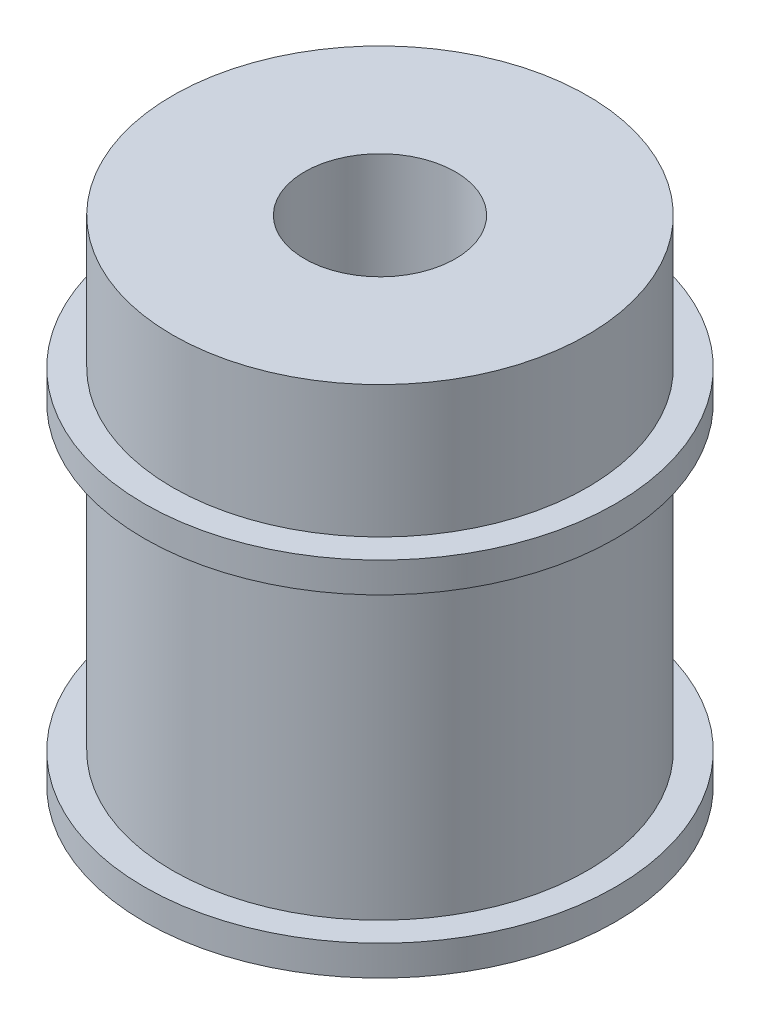
ISO-10303-21;
HEADER;
FILE_DESCRIPTION(('STEP AP214'),'2;1');
FILE_NAME('part.step','',(''),(''),'','','');
FILE_SCHEMA(('AUTOMOTIVE_DESIGN { 1 0 10303 214 1 1 1 1 }'));
ENDSEC;
DATA;
#1=APPLICATION_CONTEXT('core data for automotive mechanical design processes');
#2=APPLICATION_PROTOCOL_DEFINITION('international standard','automotive_design',2000,#1);
#3=PRODUCT_CONTEXT('',#1,'mechanical');
#4=PRODUCT('Part','Part','',(#3));
#5=PRODUCT_RELATED_PRODUCT_CATEGORY('part','',(#4));
#6=PRODUCT_DEFINITION_FORMATION('','',#4);
#7=PRODUCT_DEFINITION_CONTEXT('part definition',#1,'design');
#8=PRODUCT_DEFINITION('design','',#6,#7);
#9=PRODUCT_DEFINITION_SHAPE('','',#8);
#10=(LENGTH_UNIT() NAMED_UNIT(*) SI_UNIT(.MILLI.,.METRE.));
#11=(NAMED_UNIT(*) PLANE_ANGLE_UNIT() SI_UNIT($,.RADIAN.));
#12=(NAMED_UNIT(*) SI_UNIT($,.STERADIAN.) SOLID_ANGLE_UNIT());
#13=UNCERTAINTY_MEASURE_WITH_UNIT(LENGTH_MEASURE(1.E-05),#10,'distance_accuracy_value','');
#14=(GEOMETRIC_REPRESENTATION_CONTEXT(3) GLOBAL_UNCERTAINTY_ASSIGNED_CONTEXT((#13)) GLOBAL_UNIT_ASSIGNED_CONTEXT((#10,
#11,#12)) REPRESENTATION_CONTEXT('',''));
#15=CARTESIAN_POINT('',(0.,0.,0.));
#16=DIRECTION('',(0.,0.,1.));
#17=DIRECTION('',(1.,0.,0.));
#18=AXIS2_PLACEMENT_3D('',#15,#16,#17);
#19=CARTESIAN_POINT('',(0.,1.6,0.));
#20=DIRECTION('',(0.,-1.,0.));
#21=DIRECTION('',(0.,0.,-1.));
#22=AXIS2_PLACEMENT_3D('',#19,#20,#21);
#23=CYLINDRICAL_SURFACE('',#22,12.5);
#24=CARTESIAN_POINT('',(0.,1.6,0.));
#25=DIRECTION('',(0.,1.,0.));
#26=DIRECTION('',(0.,0.,1.));
#27=AXIS2_PLACEMENT_3D('',#24,#25,#26);
#28=CIRCLE('',#27,12.5);
#29=CARTESIAN_POINT('',(0.,1.6,12.5));
#30=VERTEX_POINT('',#29);
#31=EDGE_CURVE('E48',#30,#30,#28,.T.);
#32=ORIENTED_EDGE('',*,*,#31,.F.);
#33=EDGE_LOOP('',(#32));
#34=FACE_BOUND('',#33,.T.);
#35=CARTESIAN_POINT('',(0.,0.,0.));
#36=DIRECTION('',(0.,1.,0.));
#37=DIRECTION('',(0.,0.,1.));
#38=AXIS2_PLACEMENT_3D('',#35,#36,#37);
#39=CIRCLE('',#38,12.5);
#40=CARTESIAN_POINT('',(0.,0.,12.5));
#41=VERTEX_POINT('',#40);
#42=EDGE_CURVE('E39',#41,#41,#39,.T.);
#43=ORIENTED_EDGE('',*,*,#42,.T.);
#44=EDGE_LOOP('',(#43));
#45=FACE_BOUND('',#44,.T.);
#46=ADVANCED_FACE('F36',(#34,#45),#23,.T.);
#47=CARTESIAN_POINT('',(0.,1.6,0.));
#48=DIRECTION('',(0.,1.,0.));
#49=DIRECTION('',(0.,0.,1.));
#50=AXIS2_PLACEMENT_3D('',#47,#48,#49);
#51=PLANE('',#50);
#52=CARTESIAN_POINT('',(0.,1.6,0.));
#53=DIRECTION('',(0.,1.,0.));
#54=DIRECTION('',(0.,0.,1.));
#55=AXIS2_PLACEMENT_3D('',#52,#53,#54);
#56=CIRCLE('',#55,11.);
#57=CARTESIAN_POINT('',(0.,1.6,11.));
#58=VERTEX_POINT('',#57);
#59=EDGE_CURVE('E43',#58,#58,#56,.T.);
#60=ORIENTED_EDGE('',*,*,#59,.F.);
#61=EDGE_LOOP('',(#60));
#62=FACE_BOUND('',#61,.T.);
#63=ORIENTED_EDGE('',*,*,#31,.T.);
#64=EDGE_LOOP('',(#63));
#65=FACE_BOUND('',#64,.T.);
#66=ADVANCED_FACE('F72',(#62,#65),#51,.T.);
#67=CARTESIAN_POINT('',(0.,0.,0.));
#68=DIRECTION('',(0.,1.,0.));
#69=DIRECTION('',(0.,0.,1.));
#70=AXIS2_PLACEMENT_3D('',#67,#68,#69);
#71=PLANE('',#70);
#72=CARTESIAN_POINT('',(0.,0.,0.));
#73=DIRECTION('',(0.,-1.,0.));
#74=DIRECTION('',(0.,0.,-1.));
#75=AXIS2_PLACEMENT_3D('',#72,#73,#74);
#76=CIRCLE('',#75,4.);
#77=CARTESIAN_POINT('',(0.,0.,-4.));
#78=VERTEX_POINT('',#77);
#79=EDGE_CURVE('E170',#78,#78,#76,.T.);
#80=ORIENTED_EDGE('',*,*,#79,.F.);
#81=EDGE_LOOP('',(#80));
#82=FACE_BOUND('',#81,.T.);
#83=ORIENTED_EDGE('',*,*,#42,.F.);
#84=EDGE_LOOP('',(#83));
#85=FACE_BOUND('',#84,.T.);
#86=ADVANCED_FACE('F69',(#82,#85),#71,.F.);
#87=CARTESIAN_POINT('',(0.,17.6,0.));
#88=DIRECTION('',(0.,-1.,0.));
#89=DIRECTION('',(0.,0.,-1.));
#90=AXIS2_PLACEMENT_3D('',#87,#88,#89);
#91=CYLINDRICAL_SURFACE('',#90,11.);
#92=CARTESIAN_POINT('',(0.,17.6,0.));
#93=DIRECTION('',(0.,1.,0.));
#94=DIRECTION('',(0.,0.,1.));
#95=AXIS2_PLACEMENT_3D('',#92,#93,#94);
#96=CIRCLE('',#95,11.);
#97=CARTESIAN_POINT('',(0.,17.6,11.));
#98=VERTEX_POINT('',#97);
#99=EDGE_CURVE('E57',#98,#98,#96,.T.);
#100=ORIENTED_EDGE('',*,*,#99,.F.);
#101=EDGE_LOOP('',(#100));
#102=FACE_BOUND('',#101,.T.);
#103=ORIENTED_EDGE('',*,*,#59,.T.);
#104=EDGE_LOOP('',(#103));
#105=FACE_BOUND('',#104,.T.);
#106=ADVANCED_FACE('F71',(#102,#105),#91,.T.);
#107=CARTESIAN_POINT('',(0.,19.2,0.));
#108=DIRECTION('',(0.,-1.,0.));
#109=DIRECTION('',(0.,0.,-1.));
#110=AXIS2_PLACEMENT_3D('',#107,#108,#109);
#111=CYLINDRICAL_SURFACE('',#110,12.5);
#112=CARTESIAN_POINT('',(0.,19.2,0.));
#113=DIRECTION('',(0.,1.,0.));
#114=DIRECTION('',(0.,0.,1.));
#115=AXIS2_PLACEMENT_3D('',#112,#113,#114);
#116=CIRCLE('',#115,12.5);
#117=CARTESIAN_POINT('',(0.,19.2,12.5));
#118=VERTEX_POINT('',#117);
#119=EDGE_CURVE('E54',#118,#118,#116,.T.);
#120=ORIENTED_EDGE('',*,*,#119,.F.);
#121=EDGE_LOOP('',(#120));
#122=FACE_BOUND('',#121,.T.);
#123=CARTESIAN_POINT('',(0.,17.6,0.));
#124=DIRECTION('',(0.,1.,0.));
#125=DIRECTION('',(0.,0.,1.));
#126=AXIS2_PLACEMENT_3D('',#123,#124,#125);
#127=CIRCLE('',#126,12.5);
#128=CARTESIAN_POINT('',(0.,17.6,12.5));
#129=VERTEX_POINT('',#128);
#130=EDGE_CURVE('E58',#129,#129,#127,.T.);
#131=ORIENTED_EDGE('',*,*,#130,.T.);
#132=EDGE_LOOP('',(#131));
#133=FACE_BOUND('',#132,.T.);
#134=ADVANCED_FACE('F78',(#122,#133),#111,.T.);
#135=CARTESIAN_POINT('',(0.,19.2,0.));
#136=DIRECTION('',(0.,1.,0.));
#137=DIRECTION('',(0.,0.,1.));
#138=AXIS2_PLACEMENT_3D('',#135,#136,#137);
#139=PLANE('',#138);
#140=CARTESIAN_POINT('',(0.,19.2,0.));
#141=DIRECTION('',(0.,1.,0.));
#142=DIRECTION('',(0.,0.,1.));
#143=AXIS2_PLACEMENT_3D('',#140,#141,#142);
#144=CIRCLE('',#143,11.);
#145=CARTESIAN_POINT('',(0.,19.2,11.));
#146=VERTEX_POINT('',#145);
#147=EDGE_CURVE('E10',#146,#146,#144,.T.);
#148=ORIENTED_EDGE('',*,*,#147,.F.);
#149=EDGE_LOOP('',(#148));
#150=FACE_BOUND('',#149,.T.);
#151=ORIENTED_EDGE('',*,*,#119,.T.);
#152=EDGE_LOOP('',(#151));
#153=FACE_BOUND('',#152,.T.);
#154=ADVANCED_FACE('F108',(#150,#153),#139,.T.);
#155=CARTESIAN_POINT('',(0.,17.6,0.));
#156=DIRECTION('',(0.,1.,0.));
#157=DIRECTION('',(0.,0.,1.));
#158=AXIS2_PLACEMENT_3D('',#155,#156,#157);
#159=PLANE('',#158);
#160=ORIENTED_EDGE('',*,*,#99,.T.);
#161=EDGE_LOOP('',(#160));
#162=FACE_BOUND('',#161,.T.);
#163=ORIENTED_EDGE('',*,*,#130,.F.);
#164=EDGE_LOOP('',(#163));
#165=FACE_BOUND('',#164,.T.);
#166=ADVANCED_FACE('F116',(#162,#165),#159,.F.);
#167=CARTESIAN_POINT('',(0.,26.2,0.));
#168=DIRECTION('',(0.,-1.,0.));
#169=DIRECTION('',(0.,0.,-1.));
#170=AXIS2_PLACEMENT_3D('',#167,#168,#169);
#171=CYLINDRICAL_SURFACE('',#170,11.);
#172=CARTESIAN_POINT('',(0.,26.2,0.));
#173=DIRECTION('',(0.,1.,0.));
#174=DIRECTION('',(0.,0.,1.));
#175=AXIS2_PLACEMENT_3D('',#172,#173,#174);
#176=CIRCLE('',#175,11.);
#177=CARTESIAN_POINT('',(0.,26.2,11.));
#178=VERTEX_POINT('',#177);
#179=EDGE_CURVE('E52',#178,#178,#176,.T.);
#180=ORIENTED_EDGE('',*,*,#179,.F.);
#181=EDGE_LOOP('',(#180));
#182=FACE_BOUND('',#181,.T.);
#183=ORIENTED_EDGE('',*,*,#147,.T.);
#184=EDGE_LOOP('',(#183));
#185=FACE_BOUND('',#184,.T.);
#186=ADVANCED_FACE('F121',(#182,#185),#171,.T.);
#187=CARTESIAN_POINT('',(0.,26.2,0.));
#188=DIRECTION('',(0.,1.,0.));
#189=DIRECTION('',(0.,0.,1.));
#190=AXIS2_PLACEMENT_3D('',#187,#188,#189);
#191=PLANE('',#190);
#192=CARTESIAN_POINT('',(0.,26.2,0.));
#193=DIRECTION('',(0.,-1.,0.));
#194=DIRECTION('',(0.,0.,-1.));
#195=AXIS2_PLACEMENT_3D('',#192,#193,#194);
#196=CIRCLE('',#195,4.);
#197=CARTESIAN_POINT('',(0.,26.2,-4.));
#198=VERTEX_POINT('',#197);
#199=EDGE_CURVE('E168',#198,#198,#196,.T.);
#200=ORIENTED_EDGE('',*,*,#199,.T.);
#201=EDGE_LOOP('',(#200));
#202=FACE_BOUND('',#201,.T.);
#203=ORIENTED_EDGE('',*,*,#179,.T.);
#204=EDGE_LOOP('',(#203));
#205=FACE_BOUND('',#204,.T.);
#206=ADVANCED_FACE('F137',(#202,#205),#191,.T.);
#207=CARTESIAN_POINT('',(0.,26.2,0.));
#208=DIRECTION('',(0.,-1.,0.));
#209=DIRECTION('',(0.,0.,-1.));
#210=AXIS2_PLACEMENT_3D('',#207,#208,#209);
#211=CYLINDRICAL_SURFACE('',#210,4.);
#212=ORIENTED_EDGE('',*,*,#199,.F.);
#213=EDGE_LOOP('',(#212));
#214=FACE_BOUND('',#213,.T.);
#215=ORIENTED_EDGE('',*,*,#79,.T.);
#216=EDGE_LOOP('',(#215));
#217=FACE_BOUND('',#216,.T.);
#218=ADVANCED_FACE('F151',(#214,#217),#211,.F.);
#219=CLOSED_SHELL('',(#46,#66,#86,#106,#134,#154,#166,#186,#206,#218));
#220=MANIFOLD_SOLID_BREP('B2',#219);
#221=ADVANCED_BREP_SHAPE_REPRESENTATION('',(#18,#220),#14);
#222=SHAPE_DEFINITION_REPRESENTATION(#9,#221);
ENDSEC;
END-ISO-10303-21;
